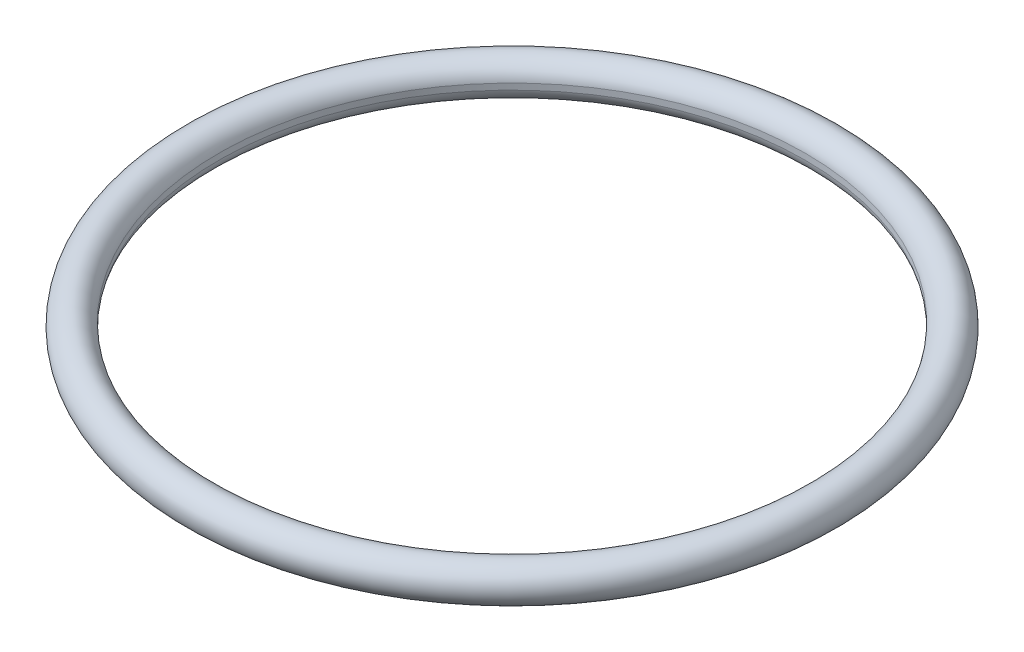
ISO-10303-21;
HEADER;
FILE_DESCRIPTION(('STEP AP214'),'2;1');
FILE_NAME('part.step','',(''),(''),'','','');
FILE_SCHEMA(('AUTOMOTIVE_DESIGN { 1 0 10303 214 1 1 1 1 }'));
ENDSEC;
DATA;
#1=APPLICATION_CONTEXT('core data for automotive mechanical design processes');
#2=APPLICATION_PROTOCOL_DEFINITION('international standard','automotive_design',2000,#1);
#3=PRODUCT_CONTEXT('',#1,'mechanical');
#4=PRODUCT('Part','Part','',(#3));
#5=PRODUCT_RELATED_PRODUCT_CATEGORY('part','',(#4));
#6=PRODUCT_DEFINITION_FORMATION('','',#4);
#7=PRODUCT_DEFINITION_CONTEXT('part definition',#1,'design');
#8=PRODUCT_DEFINITION('design','',#6,#7);
#9=PRODUCT_DEFINITION_SHAPE('','',#8);
#10=(LENGTH_UNIT() NAMED_UNIT(*) SI_UNIT(.MILLI.,.METRE.));
#11=(NAMED_UNIT(*) PLANE_ANGLE_UNIT() SI_UNIT($,.RADIAN.));
#12=(NAMED_UNIT(*) SI_UNIT($,.STERADIAN.) SOLID_ANGLE_UNIT());
#13=UNCERTAINTY_MEASURE_WITH_UNIT(LENGTH_MEASURE(1.E-05),#10,'distance_accuracy_value','');
#14=(GEOMETRIC_REPRESENTATION_CONTEXT(3) GLOBAL_UNCERTAINTY_ASSIGNED_CONTEXT((#13)) GLOBAL_UNIT_ASSIGNED_CONTEXT((#10,
#11,#12)) REPRESENTATION_CONTEXT('',''));
#15=CARTESIAN_POINT('',(0.,0.,0.));
#16=DIRECTION('',(0.,0.,1.));
#17=DIRECTION('',(1.,0.,0.));
#18=AXIS2_PLACEMENT_3D('',#15,#16,#17);
#19=CARTESIAN_POINT('',(0.,0.,0.));
#20=DIRECTION('',(0.,-1.,0.));
#21=DIRECTION('',(0.,0.,-1.));
#22=AXIS2_PLACEMENT_3D('',#19,#20,#21);
#23=TOROIDAL_SURFACE('',#22,25.5,1.5);
#24=CARTESIAN_POINT('',(0.,-0.25,0.));
#25=DIRECTION('',(0.,-1.,0.));
#26=DIRECTION('',(0.,0.,-1.));
#27=AXIS2_PLACEMENT_3D('',#24,#25,#26);
#28=CIRCLE('',#27,24.0209800542251);
#29=CARTESIAN_POINT('',(0.,-0.25,-24.0209800542251));
#30=VERTEX_POINT('',#29);
#31=EDGE_CURVE('E10',#30,#30,#28,.T.);
#32=ORIENTED_EDGE('',*,*,#31,.F.);
#33=EDGE_LOOP('',(#32));
#34=FACE_BOUND('',#33,.T.);
#35=CARTESIAN_POINT('',(0.,0.25,0.));
#36=DIRECTION('',(0.,-1.,0.));
#37=DIRECTION('',(0.,0.,-1.));
#38=AXIS2_PLACEMENT_3D('',#35,#36,#37);
#39=CIRCLE('',#38,24.0209800542251);
#40=CARTESIAN_POINT('',(0.,0.25,-24.0209800542251));
#41=VERTEX_POINT('',#40);
#42=EDGE_CURVE('E45',#41,#41,#39,.T.);
#43=ORIENTED_EDGE('',*,*,#42,.T.);
#44=EDGE_LOOP('',(#43));
#45=FACE_BOUND('',#44,.T.);
#46=ADVANCED_FACE('F39',(#34,#45),#23,.T.);
#47=CARTESIAN_POINT('',(0.,0.,0.));
#48=DIRECTION('',(0.,-1.,0.));
#49=DIRECTION('',(0.,0.,-1.));
#50=AXIS2_PLACEMENT_3D('',#47,#48,#49);
#51=CYLINDRICAL_SURFACE('',#50,24.0209800542251);
#52=ORIENTED_EDGE('',*,*,#42,.F.);
#53=EDGE_LOOP('',(#52));
#54=FACE_BOUND('',#53,.T.);
#55=ORIENTED_EDGE('',*,*,#31,.T.);
#56=EDGE_LOOP('',(#55));
#57=FACE_BOUND('',#56,.T.);
#58=ADVANCED_FACE('F52',(#54,#57),#51,.F.);
#59=CLOSED_SHELL('',(#46,#58));
#60=MANIFOLD_SOLID_BREP('B2',#59);
#61=ADVANCED_BREP_SHAPE_REPRESENTATION('',(#18,#60),#14);
#62=SHAPE_DEFINITION_REPRESENTATION(#9,#61);
ENDSEC;
END-ISO-10303-21;
